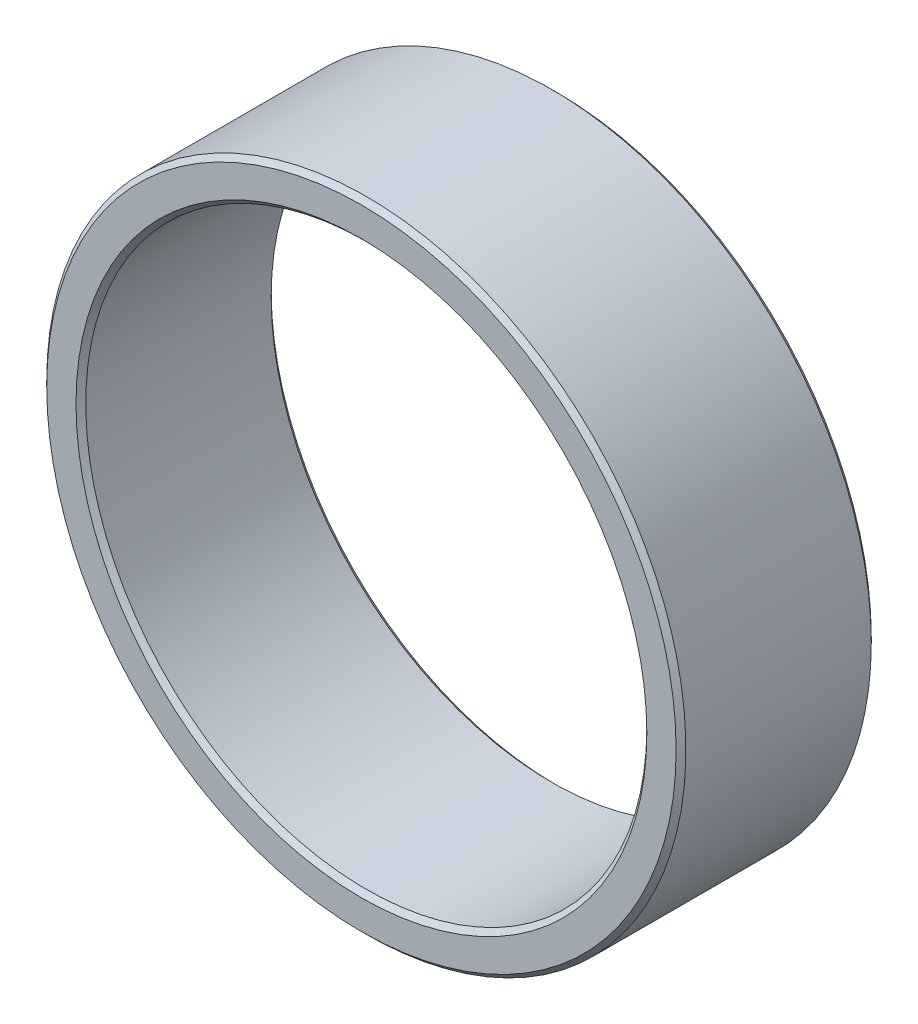
ISO-10303-21;
HEADER;
FILE_DESCRIPTION(('STEP AP214'),'2;1');
FILE_NAME('part.step','',(''),(''),'','','');
FILE_SCHEMA(('AUTOMOTIVE_DESIGN { 1 0 10303 214 1 1 1 1 }'));
ENDSEC;
DATA;
#1=APPLICATION_CONTEXT('core data for automotive mechanical design processes');
#2=APPLICATION_PROTOCOL_DEFINITION('international standard','automotive_design',2000,#1);
#3=PRODUCT_CONTEXT('',#1,'mechanical');
#4=PRODUCT('Part','Part','',(#3));
#5=PRODUCT_RELATED_PRODUCT_CATEGORY('part','',(#4));
#6=PRODUCT_DEFINITION_FORMATION('','',#4);
#7=PRODUCT_DEFINITION_CONTEXT('part definition',#1,'design');
#8=PRODUCT_DEFINITION('design','',#6,#7);
#9=PRODUCT_DEFINITION_SHAPE('','',#8);
#10=(LENGTH_UNIT() NAMED_UNIT(*) SI_UNIT(.MILLI.,.METRE.));
#11=(NAMED_UNIT(*) PLANE_ANGLE_UNIT() SI_UNIT($,.RADIAN.));
#12=(NAMED_UNIT(*) SI_UNIT($,.STERADIAN.) SOLID_ANGLE_UNIT());
#13=UNCERTAINTY_MEASURE_WITH_UNIT(LENGTH_MEASURE(1.E-05),#10,'distance_accuracy_value','');
#14=(GEOMETRIC_REPRESENTATION_CONTEXT(3) GLOBAL_UNCERTAINTY_ASSIGNED_CONTEXT((#13)) GLOBAL_UNIT_ASSIGNED_CONTEXT((#10,
#11,#12)) REPRESENTATION_CONTEXT('',''));
#15=CARTESIAN_POINT('',(0.,0.,0.));
#16=DIRECTION('',(0.,0.,1.));
#17=DIRECTION('',(1.,0.,0.));
#18=AXIS2_PLACEMENT_3D('',#15,#16,#17);
#19=CARTESIAN_POINT('',(0.,0.,-2.));
#20=DIRECTION('',(0.,0.,-1.));
#21=DIRECTION('',(-1.,0.,0.));
#22=AXIS2_PLACEMENT_3D('',#19,#20,#21);
#23=CYLINDRICAL_SURFACE('',#22,5.75);
#24=CARTESIAN_POINT('',(0.,0.,-0.100000000031741));
#25=DIRECTION('',(0.,0.,1.));
#26=DIRECTION('',(0.,1.,0.));
#27=AXIS2_PLACEMENT_3D('',#24,#25,#26);
#28=CIRCLE('',#27,5.74999999992087);
#29=CARTESIAN_POINT('',(0.,5.74999999992087,-0.100000000031741));
#30=VERTEX_POINT('',#29);
#31=EDGE_CURVE('E32',#30,#30,#28,.T.);
#32=ORIENTED_EDGE('',*,*,#31,.T.);
#33=EDGE_LOOP('',(#32));
#34=FACE_BOUND('',#33,.T.);
#35=CARTESIAN_POINT('',(0.,0.,-3.89999999993051));
#36=DIRECTION('',(0.,0.,-1.));
#37=DIRECTION('',(0.,1.,0.));
#38=AXIS2_PLACEMENT_3D('',#35,#36,#37);
#39=CIRCLE('',#38,5.74999999997772);
#40=CARTESIAN_POINT('',(0.,5.74999999997772,-3.89999999993051));
#41=VERTEX_POINT('',#40);
#42=EDGE_CURVE('E29',#41,#41,#39,.T.);
#43=ORIENTED_EDGE('',*,*,#42,.T.);
#44=EDGE_LOOP('',(#43));
#45=FACE_BOUND('',#44,.T.);
#46=ADVANCED_FACE('F14',(#34,#45),#23,.F.);
#47=CARTESIAN_POINT('',(0.,0.,5.6843418860808E-11));
#48=DIRECTION('',(0.,0.,1.));
#49=DIRECTION('',(1.,0.,0.));
#50=AXIS2_PLACEMENT_3D('',#47,#48,#49);
#51=CONICAL_SURFACE('',#50,5.8500000000663,0.785398163681665);
#52=CARTESIAN_POINT('',(0.,0.,-5.68434187961845E-11));
#53=DIRECTION('',(0.,0.,1.));
#54=DIRECTION('',(1.,0.,0.));
#55=AXIS2_PLACEMENT_3D('',#52,#53,#54);
#56=CIRCLE('',#55,5.84999999995262);
#57=CARTESIAN_POINT('',(5.84999999995262,0.,-5.68434187961845E-11));
#58=VERTEX_POINT('',#57);
#59=EDGE_CURVE('E17',#58,#58,#56,.F.);
#60=ORIENTED_EDGE('',*,*,#59,.F.);
#61=EDGE_LOOP('',(#60));
#62=FACE_BOUND('',#61,.T.);
#63=ORIENTED_EDGE('',*,*,#31,.F.);
#64=EDGE_LOOP('',(#63));
#65=FACE_BOUND('',#64,.T.);
#66=ADVANCED_FACE('F49',(#62,#65),#51,.F.);
#67=CARTESIAN_POINT('',(0.,0.,-3.99999999996226));
#68=DIRECTION('',(0.,0.,-1.));
#69=DIRECTION('',(-1.,0.,0.));
#70=AXIS2_PLACEMENT_3D('',#67,#68,#69);
#71=CONICAL_SURFACE('',#70,5.85000000000946,0.785398163397448);
#72=ORIENTED_EDGE('',*,*,#42,.F.);
#73=EDGE_LOOP('',(#72));
#74=FACE_BOUND('',#73,.T.);
#75=CARTESIAN_POINT('',(0.,0.,-3.99999999996226));
#76=DIRECTION('',(0.,0.,-1.));
#77=DIRECTION('',(-1.,0.,0.));
#78=AXIS2_PLACEMENT_3D('',#75,#76,#77);
#79=CIRCLE('',#78,5.85000000000946);
#80=CARTESIAN_POINT('',(-5.85000000000946,0.,-3.99999999996226));
#81=VERTEX_POINT('',#80);
#82=EDGE_CURVE('E39',#81,#81,#79,.F.);
#83=ORIENTED_EDGE('',*,*,#82,.F.);
#84=EDGE_LOOP('',(#83));
#85=FACE_BOUND('',#84,.T.);
#86=ADVANCED_FACE('F52',(#74,#85),#71,.F.);
#87=CARTESIAN_POINT('',(0.,6.15,0.));
#88=DIRECTION('',(0.,0.,1.));
#89=DIRECTION('',(1.,0.,0.));
#90=AXIS2_PLACEMENT_3D('',#87,#88,#89);
#91=PLANE('',#90);
#92=ORIENTED_EDGE('',*,*,#59,.T.);
#93=EDGE_LOOP('',(#92));
#94=FACE_BOUND('',#93,.T.);
#95=CARTESIAN_POINT('',(0.,0.,0.));
#96=DIRECTION('',(0.,0.,-1.));
#97=DIRECTION('',(-1.,0.,0.));
#98=AXIS2_PLACEMENT_3D('',#95,#96,#97);
#99=CIRCLE('',#98,6.45000000002938);
#100=CARTESIAN_POINT('',(-6.45000000002938,0.,0.));
#101=VERTEX_POINT('',#100);
#102=EDGE_CURVE('E37',#101,#101,#99,.T.);
#103=ORIENTED_EDGE('',*,*,#102,.F.);
#104=EDGE_LOOP('',(#103));
#105=FACE_BOUND('',#104,.T.);
#106=ADVANCED_FACE('F46',(#94,#105),#91,.T.);
#107=CARTESIAN_POINT('',(0.,6.15,-4.));
#108=DIRECTION('',(0.,0.,-1.));
#109=DIRECTION('',(-1.,0.,0.));
#110=AXIS2_PLACEMENT_3D('',#107,#108,#109);
#111=PLANE('',#110);
#112=CARTESIAN_POINT('',(0.,0.,-3.99999999996226));
#113=DIRECTION('',(0.,0.,1.));
#114=DIRECTION('',(1.,0.,0.));
#115=AXIS2_PLACEMENT_3D('',#112,#113,#114);
#116=CIRCLE('',#115,6.45000000002938);
#117=CARTESIAN_POINT('',(6.45000000002938,0.,-3.99999999996226));
#118=VERTEX_POINT('',#117);
#119=EDGE_CURVE('E26',#118,#118,#116,.T.);
#120=ORIENTED_EDGE('',*,*,#119,.F.);
#121=EDGE_LOOP('',(#120));
#122=FACE_BOUND('',#121,.T.);
#123=ORIENTED_EDGE('',*,*,#82,.T.);
#124=EDGE_LOOP('',(#123));
#125=FACE_BOUND('',#124,.T.);
#126=ADVANCED_FACE('F67',(#122,#125),#111,.T.);
#127=CARTESIAN_POINT('',(0.,0.,-0.100000000088585));
#128=DIRECTION('',(0.,0.,-1.));
#129=DIRECTION('',(-1.,0.,0.));
#130=AXIS2_PLACEMENT_3D('',#127,#128,#129);
#131=CONICAL_SURFACE('',#130,6.55000000011796,0.785398163397448);
#132=ORIENTED_EDGE('',*,*,#102,.T.);
#133=EDGE_LOOP('',(#132));
#134=FACE_BOUND('',#133,.T.);
#135=CARTESIAN_POINT('',(0.,0.,-0.1));
#136=DIRECTION('',(0.,0.,-1.));
#137=DIRECTION('',(-1.,0.,0.));
#138=AXIS2_PLACEMENT_3D('',#135,#136,#137);
#139=CIRCLE('',#138,6.55);
#140=CARTESIAN_POINT('',(-6.55,0.,-0.1));
#141=VERTEX_POINT('',#140);
#142=EDGE_CURVE('E21',#141,#141,#139,.T.);
#143=ORIENTED_EDGE('',*,*,#142,.F.);
#144=EDGE_LOOP('',(#143));
#145=FACE_BOUND('',#144,.T.);
#146=ADVANCED_FACE('F78',(#134,#145),#131,.T.);
#147=CARTESIAN_POINT('',(0.,0.,-3.89999999998736));
#148=DIRECTION('',(0.,0.,1.));
#149=DIRECTION('',(1.,0.,0.));
#150=AXIS2_PLACEMENT_3D('',#147,#148,#149);
#151=CONICAL_SURFACE('',#150,6.55000000000427,0.785398163397448);
#152=ORIENTED_EDGE('',*,*,#119,.T.);
#153=EDGE_LOOP('',(#152));
#154=FACE_BOUND('',#153,.T.);
#155=CARTESIAN_POINT('',(0.,0.,-3.9));
#156=DIRECTION('',(0.,0.,-1.));
#157=DIRECTION('',(-1.,0.,0.));
#158=AXIS2_PLACEMENT_3D('',#155,#156,#157);
#159=CIRCLE('',#158,6.55);
#160=CARTESIAN_POINT('',(-6.55,0.,-3.9));
#161=VERTEX_POINT('',#160);
#162=EDGE_CURVE('E10',#161,#161,#159,.F.);
#163=ORIENTED_EDGE('',*,*,#162,.F.);
#164=EDGE_LOOP('',(#163));
#165=FACE_BOUND('',#164,.T.);
#166=ADVANCED_FACE('F71',(#154,#165),#151,.T.);
#167=CARTESIAN_POINT('',(0.,0.,-2.));
#168=DIRECTION('',(0.,0.,-1.));
#169=DIRECTION('',(-1.,0.,0.));
#170=AXIS2_PLACEMENT_3D('',#167,#168,#169);
#171=CYLINDRICAL_SURFACE('',#170,6.55);
#172=ORIENTED_EDGE('',*,*,#142,.T.);
#173=EDGE_LOOP('',(#172));
#174=FACE_BOUND('',#173,.T.);
#175=ORIENTED_EDGE('',*,*,#162,.T.);
#176=EDGE_LOOP('',(#175));
#177=FACE_BOUND('',#176,.T.);
#178=ADVANCED_FACE('F69',(#174,#177),#171,.T.);
#179=CLOSED_SHELL('',(#46,#66,#86,#106,#126,#146,#166,#178));
#180=MANIFOLD_SOLID_BREP('B1',#179);
#181=ADVANCED_BREP_SHAPE_REPRESENTATION('',(#18,#180),#14);
#182=SHAPE_DEFINITION_REPRESENTATION(#9,#181);
ENDSEC;
END-ISO-10303-21;
